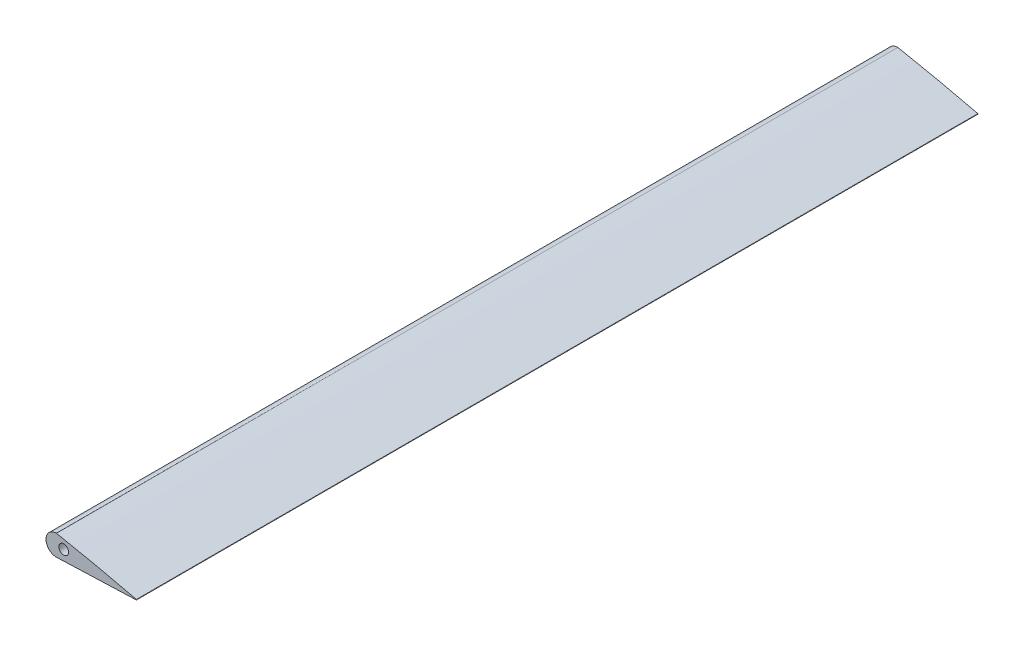
ISO-10303-21;
HEADER;
FILE_DESCRIPTION(('STEP AP214'),'2;1');
FILE_NAME('part.step','',(''),(''),'','','');
FILE_SCHEMA(('AUTOMOTIVE_DESIGN { 1 0 10303 214 1 1 1 1 }'));
ENDSEC;
DATA;
#1=APPLICATION_CONTEXT('core data for automotive mechanical design processes');
#2=APPLICATION_PROTOCOL_DEFINITION('international standard','automotive_design',2000,#1);
#3=PRODUCT_CONTEXT('',#1,'mechanical');
#4=PRODUCT('Part','Part','',(#3));
#5=PRODUCT_RELATED_PRODUCT_CATEGORY('part','',(#4));
#6=PRODUCT_DEFINITION_FORMATION('','',#4);
#7=PRODUCT_DEFINITION_CONTEXT('part definition',#1,'design');
#8=PRODUCT_DEFINITION('design','',#6,#7);
#9=PRODUCT_DEFINITION_SHAPE('','',#8);
#10=(LENGTH_UNIT() NAMED_UNIT(*) SI_UNIT(.MILLI.,.METRE.));
#11=(NAMED_UNIT(*) PLANE_ANGLE_UNIT() SI_UNIT($,.RADIAN.));
#12=(NAMED_UNIT(*) SI_UNIT($,.STERADIAN.) SOLID_ANGLE_UNIT());
#13=UNCERTAINTY_MEASURE_WITH_UNIT(LENGTH_MEASURE(1.E-05),#10,'distance_accuracy_value','');
#14=(GEOMETRIC_REPRESENTATION_CONTEXT(3) GLOBAL_UNCERTAINTY_ASSIGNED_CONTEXT((#13)) GLOBAL_UNIT_ASSIGNED_CONTEXT((#10,
#11,#12)) REPRESENTATION_CONTEXT('',''));
#15=CARTESIAN_POINT('',(0.,0.,0.));
#16=DIRECTION('',(0.,0.,1.));
#17=DIRECTION('',(1.,0.,0.));
#18=AXIS2_PLACEMENT_3D('',#15,#16,#17);
#19=CARTESIAN_POINT('',(164.,0.098236,1246.6));
#20=CARTESIAN_POINT('',(163.453347386671,0.227855350458952,1246.6));
#21=CARTESIAN_POINT('',(162.360115671758,0.487076620664547,1246.6));
#22=CARTESIAN_POINT('',(160.720174081031,0.8748027913242,1246.6));
#23=CARTESIAN_POINT('',(159.080335299599,1.2611135108875,1246.6));
#24=CARTESIAN_POINT('',(156.894331895889,1.77189659204999,1246.6));
#25=CARTESIAN_POINT('',(154.161962419369,2.40100802385925,1246.6));
#26=CARTESIAN_POINT('',(150.881840500926,3.1375256901344,1246.6));
#27=CARTESIAN_POINT('',(147.601664877829,3.85659449964915,1246.6));
#28=CARTESIAN_POINT('',(144.321701501382,4.55985226737601,1246.6));
#29=CARTESIAN_POINT('',(141.041699291482,5.24621809732109,1246.6));
#30=CARTESIAN_POINT('',(137.761756820069,5.91557197661805,1246.6));
#31=CARTESIAN_POINT('',(134.481686048208,6.56653427941028,1246.6));
#32=CARTESIAN_POINT('',(131.201761117117,7.19989778417141,1246.6));
#33=CARTESIAN_POINT('',(127.921667907918,7.81375356606383,1246.6));
#34=CARTESIAN_POINT('',(124.641700877236,8.40917183607385,1246.6));
#35=CARTESIAN_POINT('',(121.361597548386,8.98464976190136,1246.6));
#36=CARTESIAN_POINT('',(118.081600920828,9.54128435164297,1246.6));
#37=CARTESIAN_POINT('',(114.801560540038,10.0780590298297,1246.6));
#38=CARTESIAN_POINT('',(111.521600724131,10.5950345799163,1246.6));
#39=CARTESIAN_POINT('',(108.241713881351,11.0909646842955,1246.6));
#40=CARTESIAN_POINT('',(104.961715387484,11.5629261888805,1246.6));
#41=CARTESIAN_POINT('',(101.681785544589,12.0101669419683,1246.6));
#42=CARTESIAN_POINT('',(98.4017469245326,12.4297089334238,1246.6));
#43=CARTESIAN_POINT('',(95.1216630030627,12.8204998785934,1246.6));
#44=CARTESIAN_POINT('',(91.8415424202874,13.1818311954848,1246.6));
#45=CARTESIAN_POINT('',(88.5614135801748,13.5136296911863,1246.6));
#46=CARTESIAN_POINT('',(85.2812830129089,13.815893693455,1246.6));
#47=CARTESIAN_POINT('',(82.0011692178232,14.0886945475444,1246.6));
#48=CARTESIAN_POINT('',(78.721094583004,14.3317408411769,1246.6));
#49=CARTESIAN_POINT('',(75.4410212023817,14.5431745258036,1246.6));
#50=CARTESIAN_POINT('',(72.1608949429442,14.7199129290163,1246.6));
#51=CARTESIAN_POINT('',(68.8807258367621,14.8594278594699,1246.6));
#52=CARTESIAN_POINT('',(65.6005029177586,14.9591611868157,1246.6));
#53=CARTESIAN_POINT('',(62.3202248877231,15.0161184911894,1246.6));
#54=CARTESIAN_POINT('',(59.0399904849592,15.0330111129914,1246.6));
#55=CARTESIAN_POINT('',(55.7598149007794,15.012803506004,1246.6));
#56=CARTESIAN_POINT('',(52.4796814465771,14.9596338867567,1246.6));
#57=CARTESIAN_POINT('',(49.1996020231385,14.8756453845849,1246.6));
#58=CARTESIAN_POINT('',(45.9192330465041,14.7668246976276,1246.6));
#59=CARTESIAN_POINT('',(42.6385376039657,14.6188266715463,1246.6));
#60=CARTESIAN_POINT('',(39.3574161799392,14.4160226283782,1246.6));
#61=CARTESIAN_POINT('',(36.0757975000136,14.1416033611045,1246.6));
#62=CARTESIAN_POINT('',(32.7935336386632,13.7797355777745,1246.6));
#63=CARTESIAN_POINT('',(29.5117490863587,13.311848816541,1246.6));
#64=CARTESIAN_POINT('',(26.2304347877456,12.7369411502886,1246.6));
#65=CARTESIAN_POINT('',(22.9482106391067,12.0590867159985,1246.6));
#66=CARTESIAN_POINT('',(19.6639743780453,11.2714313088833,1246.6));
#67=CARTESIAN_POINT('',(16.3781154279843,10.3517379968201,1246.6));
#68=CARTESIAN_POINT('',(13.0927390351379,9.27164991130654,1246.6));
#69=CARTESIAN_POINT('',(10.3581556975564,8.23985590536731,1246.6));
#70=CARTESIAN_POINT('',(8.17874341440028,7.26915270171108,1246.6));
#71=CARTESIAN_POINT('',(6.52711920655236,6.42362871815544,1246.6));
#72=CARTESIAN_POINT('',(4.8606326051585,5.41901455288728,1246.6));
#73=CARTESIAN_POINT('',(3.32216784213193,4.2467281999024,1246.6));
#74=CARTESIAN_POINT('',(2.16677990383352,3.13421853144612,1246.6));
#75=CARTESIAN_POINT('',(1.28484362701116,2.24003834899123,1246.6));
#76=CARTESIAN_POINT('',(0.72477847607304,1.58632625202643,1246.6));
#77=CARTESIAN_POINT('',(0.35648721556683,1.02371456627432,1246.6));
#78=CARTESIAN_POINT('',(0.176338644180926,0.655158851073157,1246.6));
#79=CARTESIAN_POINT('',(0.0612611395106372,0.337632955086773,1246.6));
#80=CARTESIAN_POINT('',(-0.0429121865202662,-0.121140296790297,1246.6));
#81=CARTESIAN_POINT('',(0.010077208925072,-0.598533270573657,1246.6));
#82=CARTESIAN_POINT('',(0.176198667745624,-1.01407787652228,1246.6));
#83=CARTESIAN_POINT('',(0.354673421549138,-1.34452507475123,1246.6));
#84=CARTESIAN_POINT('',(0.717110179714685,-1.82624030553599,1246.6));
#85=CARTESIAN_POINT('',(1.26977260153434,-2.33677484867151,1246.6));
#86=CARTESIAN_POINT('',(2.13175393776129,-2.92020441398472,1246.6));
#87=CARTESIAN_POINT('',(3.35494447776376,-3.3927891066928,1246.6));
#88=CARTESIAN_POINT('',(4.91531848514269,-3.70716670555496,1246.6));
#89=CARTESIAN_POINT('',(6.55415647727891,-4.03304969461932,1246.6));
#90=CARTESIAN_POINT('',(8.19533877766632,-4.28351567057608,1246.6));
#91=CARTESIAN_POINT('',(10.3822695733583,-4.51540047764127,1246.6));
#92=CARTESIAN_POINT('',(13.1186249251783,-4.67265304154677,1246.6));
#93=CARTESIAN_POINT('',(16.3988579729893,-4.82847557553279,1246.6));
#94=CARTESIAN_POINT('',(19.6794940200121,-4.9221269224633,1246.6));
#95=CARTESIAN_POINT('',(22.9598439452861,-4.96653444382741,1246.6));
#96=CARTESIAN_POINT('',(26.2400949207719,-4.9678853332589,1246.6));
#97=CARTESIAN_POINT('',(29.5202180796211,-4.93284058420912,1246.6));
#98=CARTESIAN_POINT('',(32.8002579900583,-4.8689493564345,1246.6));
#99=CARTESIAN_POINT('',(36.080251417321,-4.78267153882756,1246.6));
#100=CARTESIAN_POINT('',(39.360205991376,-4.67900202490651,1246.6));
#101=CARTESIAN_POINT('',(42.6401302310176,-4.56299213669189,1246.6));
#102=CARTESIAN_POINT('',(45.9200507833793,-4.43994519774915,1246.6));
#103=CARTESIAN_POINT('',(49.1999634238303,-4.31409585740894,1246.6));
#104=CARTESIAN_POINT('',(52.479955348434,-4.19074867403074,1246.6));
#105=CARTESIAN_POINT('',(55.7599812015837,-4.07002215466733,1246.6));
#106=CARTESIAN_POINT('',(59.0399831910091,-3.95007972297037,1246.6));
#107=CARTESIAN_POINT('',(62.3200043820552,-3.83126992795704,1246.6));
#108=CARTESIAN_POINT('',(65.6000091855952,-3.71206420486596,1246.6));
#109=CARTESIAN_POINT('',(68.8800086095087,-3.59232744073866,1246.6));
#110=CARTESIAN_POINT('',(72.1600102889574,-3.47216006055257,1246.6));
#111=CARTESIAN_POINT('',(75.4399983284211,-3.35129455058597,1246.6));
#112=CARTESIAN_POINT('',(78.7200044224965,-3.23070144154958,1246.6));
#113=CARTESIAN_POINT('',(81.9999960438394,-3.10971523913052,1246.6));
#114=CARTESIAN_POINT('',(85.2799973322548,-2.98904612003693,1246.6));
#115=CARTESIAN_POINT('',(88.5599965582764,-2.86848494516658,1246.6));
#116=CARTESIAN_POINT('',(91.8400003924801,-2.74815868844688,1246.6));
#117=CARTESIAN_POINT('',(95.1199998668713,-2.62776837459643,1246.6));
#118=CARTESIAN_POINT('',(98.4000001400348,-2.50739981316743,1246.6));
#119=CARTESIAN_POINT('',(101.67999957299,-2.38700837273386,1246.6));
#120=CARTESIAN_POINT('',(104.960003572939,-2.26668662234937,1246.6));
#121=CARTESIAN_POINT('',(108.240000169761,-2.14610862248626,1246.6));
#122=CARTESIAN_POINT('',(111.519995748018,-2.02550288772255,1246.6));
#123=CARTESIAN_POINT('',(114.80000480859,-1.90526426839036,1246.6));
#124=CARTESIAN_POINT('',(118.079995042267,-1.78456767053152,1246.6));
#125=CARTESIAN_POINT('',(121.360004997696,-1.66435341763084,1246.6));
#126=CARTESIAN_POINT('',(124.639994991596,-1.54365029078787,1246.6));
#127=CARTESIAN_POINT('',(127.920005011275,-1.42343778737223,1246.6));
#128=CARTESIAN_POINT('',(131.199994987952,-1.30273419156792,1246.6));
#129=CARTESIAN_POINT('',(134.480005012271,-1.18252181451118,1246.6));
#130=CARTESIAN_POINT('',(137.759994987609,-1.06181818223221,1246.6));
#131=CARTESIAN_POINT('',(141.040005012646,-0.941605824715075,1246.6));
#132=CARTESIAN_POINT('',(144.319994986453,-0.820902150752307,1246.6));
#133=CARTESIAN_POINT('',(147.600005016897,-0.700689940430646,1246.6));
#134=CARTESIAN_POINT('',(150.879994970606,-0.579985719369323,1246.6));
#135=CARTESIAN_POINT('',(154.160005076031,-0.459775550244729,1246.6));
#136=CARTESIAN_POINT('',(156.893330138421,-0.359182338982628,1246.6));
#137=CARTESIAN_POINT('',(159.080000324789,-0.278972841706895,1246.6));
#138=CARTESIAN_POINT('',(160.719999512133,-0.218762723666091,1246.6));
#139=CARTESIAN_POINT('',(162.360003632975,-0.15863219006814,1246.6));
#140=CARTESIAN_POINT('',(163.453333875564,-0.118368087984547,1246.6));
#141=CARTESIAN_POINT('',(164.,-0.098236,1246.6));
#142=B_SPLINE_CURVE_WITH_KNOTS('',3,(#19,#20,#21,#22,#23,#24,#25,#26,#27,#28,#29,#30,#31,#32,
#33,#34,#35,#36,#37,#38,#39,#40,#41,#42,#43,#44,#45,#46,#47,#48,#49,#50,#51,#52,#53,#54,#55,#56,
#57,#58,#59,#60,#61,#62,#63,#64,#65,#66,#67,#68,#69,#70,#71,#72,#73,#74,#75,#76,#77,#78,#79,#80,
#81,#82,#83,#84,#85,#86,#87,#88,#89,#90,#91,#92,#93,#94,#95,#96,#97,#98,#99,#100,#101,#102,#103,
#104,#105,#106,#107,#108,#109,#110,#111,#112,#113,#114,#115,#116,#117,#118,#119,#120,#121,#122,
#123,#124,#125,#126,#127,#128,#129,#130,#131,#132,#133,#134,#135,#136,#137,#138,#139,#140,#141),
.UNSPECIFIED.,.F.,.F.,(4,1,1,1,1,1,1,1,1,1,1,1,1,1,1,1,1,1,1,1,1,1,1,1,1,1,1,1,1,1,1,1,1,1,1,1,
1,1,1,1,1,1,1,1,1,1,1,1,1,1,1,1,1,1,1,1,1,1,1,1,1,1,1,1,1,1,1,1,1,1,1,1,1,1,1,1,1,1,1,1,1,1,1,1,
1,1,1,1,1,1,1,1,1,1,1,1,1,1,1,1,1,1,1,1,1,1,1,1,1,1,1,1,1,1,1,1,1,1,1,1,4),(0.,
0.00502783507920503,0.0100549940344634,0.0150810297240759,0.0201050549080901,0.0301452607809432,
0.0401736458927437,0.0501907944797704,0.060197679895013,0.0701942255550732,0.0801803766412489,
0.0901559102827991,0.100121105793046,0.110075702815163,0.120020101260909,0.12995427083149,
0.139878706126609,0.149793490904472,0.159698811392375,0.169594433213407,0.179479778460019,
0.189354743837751,0.199219015443769,0.209072795450207,0.218916602866618,0.228751158154273,
0.238577241843568,0.248395636485294,0.258207018047657,0.268011852233636,0.277810604067606,
0.28760402315173,0.297393126728297,0.30717925271197,0.316964017963334,0.326748818989175,
0.336534714870927,0.346322473718417,0.356112722227348,0.365907651807351,0.375711463271153,
0.385530878969925,0.395375762487733,0.405259304622106,0.415192461064141,0.425184025337781,
0.435248335040234,0.445412190892236,0.455710778825161,0.466190958855658,0.471552192168147,
0.477054503678275,0.482786726573929,0.488945835105149,0.494316032866102,0.497126416153154,
0.500187367762256,0.50200086881537,0.50312820232303,0.503849971017213,0.505020136520667,
0.507317904862695,0.507986558007653,0.509023585585765,0.510668218535329,0.513358347504693,
0.515715811851598,0.519949385272463,0.524973187970153,0.529954400275476,0.534903201933464,
0.539824122915189,0.549630394385822,0.559425368878799,0.569214167199772,0.578999733437889,
0.588784364017046,0.598569510856094,0.608355932640458,0.618143879841103,0.627933314763685,
0.637723968115275,0.647515400204077,0.657307127187741,0.667098669129828,0.676889956114584,
0.68668111741491,0.69647218967302,0.706263279690747,0.716054423133804,0.725845620221906,
0.735636871174765,0.745428122127623,0.755219391084224,0.765010642037082,0.774801875010609,
0.784593090029218,0.794384305047826,0.804175520066435,0.813966735085043,0.823757950103652,
0.833549183077179,0.843340416050707,0.853131631069315,0.862922864042843,0.872714079061451,
0.882505312034978,0.892296527053587,0.902087760027114,0.911878975045723,0.92167020801925,
0.931461423037859,0.941252656011386,0.951043871029995,0.960835104003522,0.970626319022131,
0.980417551995658,0.985313159504962,0.990208767014267,0.995104374523571,1.),.UNSPECIFIED.);
#143=DIRECTION('',(0.,0.,-1.));
#144=VECTOR('',#143,1.);
#145=SURFACE_OF_LINEAR_EXTRUSION('',#142,#144);
#146=CARTESIAN_POINT('',(164.,0.098236,344.25));
#147=CARTESIAN_POINT('',(163.453347386671,0.227855350458952,344.25));
#148=CARTESIAN_POINT('',(162.360115671758,0.487076620664547,344.25));
#149=CARTESIAN_POINT('',(160.720174081031,0.8748027913242,344.25));
#150=CARTESIAN_POINT('',(159.080335299599,1.2611135108875,344.25));
#151=CARTESIAN_POINT('',(156.894331895889,1.77189659204999,344.25));
#152=CARTESIAN_POINT('',(154.161962419369,2.40100802385925,344.25));
#153=CARTESIAN_POINT('',(150.881840500926,3.1375256901344,344.25));
#154=CARTESIAN_POINT('',(147.601664877829,3.85659449964915,344.25));
#155=CARTESIAN_POINT('',(144.321701501382,4.55985226737601,344.25));
#156=CARTESIAN_POINT('',(141.041699291482,5.24621809732109,344.25));
#157=CARTESIAN_POINT('',(137.761756820069,5.91557197661805,344.25));
#158=CARTESIAN_POINT('',(134.481686048208,6.56653427941028,344.25));
#159=CARTESIAN_POINT('',(131.201761117117,7.19989778417141,344.25));
#160=CARTESIAN_POINT('',(127.921667907918,7.81375356606383,344.25));
#161=CARTESIAN_POINT('',(124.641700877236,8.40917183607385,344.25));
#162=CARTESIAN_POINT('',(121.361597548386,8.98464976190136,344.25));
#163=CARTESIAN_POINT('',(118.081600920828,9.54128435164297,344.25));
#164=CARTESIAN_POINT('',(114.801560540038,10.0780590298297,344.25));
#165=CARTESIAN_POINT('',(111.521600724131,10.5950345799163,344.25));
#166=CARTESIAN_POINT('',(108.241713881351,11.0909646842955,344.25));
#167=CARTESIAN_POINT('',(104.961715387484,11.5629261888805,344.25));
#168=CARTESIAN_POINT('',(101.681785544589,12.0101669419683,344.25));
#169=CARTESIAN_POINT('',(98.4017469245326,12.4297089334238,344.25));
#170=CARTESIAN_POINT('',(95.1216630030627,12.8204998785934,344.25));
#171=CARTESIAN_POINT('',(91.8415424202874,13.1818311954848,344.25));
#172=CARTESIAN_POINT('',(88.5614135801748,13.5136296911863,344.25));
#173=CARTESIAN_POINT('',(85.2812830129089,13.815893693455,344.25));
#174=CARTESIAN_POINT('',(82.0011692178232,14.0886945475444,344.25));
#175=CARTESIAN_POINT('',(78.721094583004,14.3317408411769,344.25));
#176=CARTESIAN_POINT('',(75.4410212023817,14.5431745258036,344.25));
#177=CARTESIAN_POINT('',(72.1608949429442,14.7199129290163,344.25));
#178=CARTESIAN_POINT('',(68.8807258367621,14.8594278594699,344.25));
#179=CARTESIAN_POINT('',(65.6005029177586,14.9591611868157,344.25));
#180=CARTESIAN_POINT('',(62.3202248877231,15.0161184911894,344.25));
#181=CARTESIAN_POINT('',(59.0399904849592,15.0330111129914,344.25));
#182=CARTESIAN_POINT('',(55.7598149007794,15.012803506004,344.25));
#183=CARTESIAN_POINT('',(52.4796814465771,14.9596338867567,344.25));
#184=CARTESIAN_POINT('',(49.1996020231385,14.8756453845849,344.25));
#185=CARTESIAN_POINT('',(45.9192330465041,14.7668246976276,344.25));
#186=CARTESIAN_POINT('',(42.6385376039657,14.6188266715463,344.25));
#187=CARTESIAN_POINT('',(39.3574161799392,14.4160226283782,344.25));
#188=CARTESIAN_POINT('',(36.0757975000136,14.1416033611045,344.25));
#189=CARTESIAN_POINT('',(32.7935336386632,13.7797355777745,344.25));
#190=CARTESIAN_POINT('',(29.5117490863587,13.311848816541,344.25));
#191=CARTESIAN_POINT('',(26.2304347877456,12.7369411502886,344.25));
#192=CARTESIAN_POINT('',(22.9482106391067,12.0590867159985,344.25));
#193=CARTESIAN_POINT('',(19.6639743780453,11.2714313088833,344.25));
#194=CARTESIAN_POINT('',(16.3781154279843,10.3517379968201,344.25));
#195=CARTESIAN_POINT('',(13.0927390351379,9.27164991130654,344.25));
#196=CARTESIAN_POINT('',(10.3581556975564,8.23985590536731,344.25));
#197=CARTESIAN_POINT('',(8.17874341440028,7.26915270171108,344.25));
#198=CARTESIAN_POINT('',(6.52711920655236,6.42362871815544,344.25));
#199=CARTESIAN_POINT('',(4.8606326051585,5.41901455288728,344.25));
#200=CARTESIAN_POINT('',(3.32216784213193,4.2467281999024,344.25));
#201=CARTESIAN_POINT('',(2.16677990383352,3.13421853144612,344.25));
#202=CARTESIAN_POINT('',(1.28484362701116,2.24003834899123,344.25));
#203=CARTESIAN_POINT('',(0.72477847607304,1.58632625202643,344.25));
#204=CARTESIAN_POINT('',(0.35648721556683,1.02371456627432,344.25));
#205=CARTESIAN_POINT('',(0.176338644180926,0.655158851073157,344.25));
#206=CARTESIAN_POINT('',(0.0612611395106372,0.337632955086773,344.25));
#207=CARTESIAN_POINT('',(-0.0429121865202662,-0.121140296790297,344.25));
#208=CARTESIAN_POINT('',(0.010077208925072,-0.598533270573657,344.25));
#209=CARTESIAN_POINT('',(0.176198667745624,-1.01407787652228,344.25));
#210=CARTESIAN_POINT('',(0.354673421549138,-1.34452507475123,344.25));
#211=CARTESIAN_POINT('',(0.717110179714685,-1.82624030553599,344.25));
#212=CARTESIAN_POINT('',(1.26977260153434,-2.33677484867151,344.25));
#213=CARTESIAN_POINT('',(2.13175393776129,-2.92020441398472,344.25));
#214=CARTESIAN_POINT('',(3.35494447776376,-3.3927891066928,344.25));
#215=CARTESIAN_POINT('',(4.91531848514269,-3.70716670555496,344.25));
#216=CARTESIAN_POINT('',(6.55415647727891,-4.03304969461932,344.25));
#217=CARTESIAN_POINT('',(8.19533877766632,-4.28351567057608,344.25));
#218=CARTESIAN_POINT('',(10.3822695733583,-4.51540047764127,344.25));
#219=CARTESIAN_POINT('',(13.1186249251783,-4.67265304154677,344.25));
#220=CARTESIAN_POINT('',(16.3988579729893,-4.82847557553279,344.25));
#221=CARTESIAN_POINT('',(19.6794940200121,-4.9221269224633,344.25));
#222=CARTESIAN_POINT('',(22.9598439452861,-4.96653444382741,344.25));
#223=CARTESIAN_POINT('',(26.2400949207719,-4.9678853332589,344.25));
#224=CARTESIAN_POINT('',(29.5202180796211,-4.93284058420912,344.25));
#225=CARTESIAN_POINT('',(32.8002579900583,-4.8689493564345,344.25));
#226=CARTESIAN_POINT('',(36.080251417321,-4.78267153882756,344.25));
#227=CARTESIAN_POINT('',(39.360205991376,-4.67900202490651,344.25));
#228=CARTESIAN_POINT('',(42.6401302310176,-4.56299213669189,344.25));
#229=CARTESIAN_POINT('',(45.9200507833793,-4.43994519774915,344.25));
#230=CARTESIAN_POINT('',(49.1999634238303,-4.31409585740894,344.25));
#231=CARTESIAN_POINT('',(52.479955348434,-4.19074867403074,344.25));
#232=CARTESIAN_POINT('',(55.7599812015837,-4.07002215466733,344.25));
#233=CARTESIAN_POINT('',(59.0399831910091,-3.95007972297037,344.25));
#234=CARTESIAN_POINT('',(62.3200043820552,-3.83126992795704,344.25));
#235=CARTESIAN_POINT('',(65.6000091855952,-3.71206420486596,344.25));
#236=CARTESIAN_POINT('',(68.8800086095087,-3.59232744073866,344.25));
#237=CARTESIAN_POINT('',(72.1600102889574,-3.47216006055257,344.25));
#238=CARTESIAN_POINT('',(75.4399983284211,-3.35129455058597,344.25));
#239=CARTESIAN_POINT('',(78.7200044224965,-3.23070144154958,344.25));
#240=CARTESIAN_POINT('',(81.9999960438394,-3.10971523913052,344.25));
#241=CARTESIAN_POINT('',(85.2799973322548,-2.98904612003693,344.25));
#242=CARTESIAN_POINT('',(88.5599965582764,-2.86848494516658,344.25));
#243=CARTESIAN_POINT('',(91.8400003924801,-2.74815868844688,344.25));
#244=CARTESIAN_POINT('',(95.1199998668713,-2.62776837459643,344.25));
#245=CARTESIAN_POINT('',(98.4000001400348,-2.50739981316743,344.25));
#246=CARTESIAN_POINT('',(101.67999957299,-2.38700837273386,344.25));
#247=CARTESIAN_POINT('',(104.960003572939,-2.26668662234937,344.25));
#248=CARTESIAN_POINT('',(108.240000169761,-2.14610862248626,344.25));
#249=CARTESIAN_POINT('',(111.519995748018,-2.02550288772255,344.25));
#250=CARTESIAN_POINT('',(114.80000480859,-1.90526426839036,344.25));
#251=CARTESIAN_POINT('',(118.079995042267,-1.78456767053152,344.25));
#252=CARTESIAN_POINT('',(121.360004997696,-1.66435341763084,344.25));
#253=CARTESIAN_POINT('',(124.639994991596,-1.54365029078787,344.25));
#254=CARTESIAN_POINT('',(127.920005011275,-1.42343778737223,344.25));
#255=CARTESIAN_POINT('',(131.199994987952,-1.30273419156792,344.25));
#256=CARTESIAN_POINT('',(134.480005012271,-1.18252181451118,344.25));
#257=CARTESIAN_POINT('',(137.759994987609,-1.06181818223221,344.25));
#258=CARTESIAN_POINT('',(141.040005012646,-0.941605824715075,344.25));
#259=CARTESIAN_POINT('',(144.319994986453,-0.820902150752307,344.25));
#260=CARTESIAN_POINT('',(147.600005016897,-0.700689940430646,344.25));
#261=CARTESIAN_POINT('',(150.879994970606,-0.579985719369323,344.25));
#262=CARTESIAN_POINT('',(154.160005076031,-0.459775550244729,344.25));
#263=CARTESIAN_POINT('',(156.893330138421,-0.359182338982628,344.25));
#264=CARTESIAN_POINT('',(159.080000324789,-0.278972841706895,344.25));
#265=CARTESIAN_POINT('',(160.719999512133,-0.218762723666091,344.25));
#266=CARTESIAN_POINT('',(162.360003632975,-0.15863219006814,344.25));
#267=CARTESIAN_POINT('',(163.453333875564,-0.118368087984547,344.25));
#268=CARTESIAN_POINT('',(164.,-0.098236,344.25));
#269=B_SPLINE_CURVE_WITH_KNOTS('',3,(#146,#147,#148,#149,#150,#151,#152,#153,#154,#155,#156,
#157,#158,#159,#160,#161,#162,#163,#164,#165,#166,#167,#168,#169,#170,#171,#172,#173,#174,#175,
#176,#177,#178,#179,#180,#181,#182,#183,#184,#185,#186,#187,#188,#189,#190,#191,#192,#193,#194,
#195,#196,#197,#198,#199,#200,#201,#202,#203,#204,#205,#206,#207,#208,#209,#210,#211,#212,#213,
#214,#215,#216,#217,#218,#219,#220,#221,#222,#223,#224,#225,#226,#227,#228,#229,#230,#231,#232,
#233,#234,#235,#236,#237,#238,#239,#240,#241,#242,#243,#244,#245,#246,#247,#248,#249,#250,#251,
#252,#253,#254,#255,#256,#257,#258,#259,#260,#261,#262,#263,#264,#265,#266,#267,#268),
.UNSPECIFIED.,.F.,.F.,(4,1,1,1,1,1,1,1,1,1,1,1,1,1,1,1,1,1,1,1,1,1,1,1,1,1,1,1,1,1,1,1,1,1,1,1,
1,1,1,1,1,1,1,1,1,1,1,1,1,1,1,1,1,1,1,1,1,1,1,1,1,1,1,1,1,1,1,1,1,1,1,1,1,1,1,1,1,1,1,1,1,1,1,1,
1,1,1,1,1,1,1,1,1,1,1,1,1,1,1,1,1,1,1,1,1,1,1,1,1,1,1,1,1,1,1,1,1,1,1,1,4),(0.,
0.00502783507920503,0.0100549940344634,0.0150810297240759,0.0201050549080901,0.0301452607809432,
0.0401736458927437,0.0501907944797704,0.060197679895013,0.0701942255550732,0.0801803766412489,
0.0901559102827991,0.100121105793046,0.110075702815163,0.120020101260909,0.12995427083149,
0.139878706126609,0.149793490904472,0.159698811392375,0.169594433213407,0.179479778460019,
0.189354743837751,0.199219015443769,0.209072795450207,0.218916602866618,0.228751158154273,
0.238577241843568,0.248395636485294,0.258207018047657,0.268011852233636,0.277810604067606,
0.28760402315173,0.297393126728297,0.30717925271197,0.316964017963334,0.326748818989175,
0.336534714870927,0.346322473718417,0.356112722227348,0.365907651807351,0.375711463271153,
0.385530878969925,0.395375762487733,0.405259304622106,0.415192461064141,0.425184025337781,
0.435248335040234,0.445412190892236,0.455710778825161,0.466190958855658,0.471552192168147,
0.477054503678275,0.482786726573929,0.488945835105149,0.494316032866102,0.497126416153154,
0.500187367762256,0.50200086881537,0.50312820232303,0.503849971017213,0.505020136520667,
0.507317904862695,0.507986558007653,0.509023585585765,0.510668218535329,0.513358347504693,
0.515715811851598,0.519949385272463,0.524973187970153,0.529954400275476,0.534903201933464,
0.539824122915189,0.549630394385822,0.559425368878799,0.569214167199772,0.578999733437889,
0.588784364017046,0.598569510856094,0.608355932640458,0.618143879841103,0.627933314763685,
0.637723968115275,0.647515400204077,0.657307127187741,0.667098669129828,0.676889956114584,
0.68668111741491,0.69647218967302,0.706263279690747,0.716054423133804,0.725845620221906,
0.735636871174765,0.745428122127623,0.755219391084224,0.765010642037082,0.774801875010609,
0.784593090029218,0.794384305047826,0.804175520066435,0.813966735085043,0.823757950103652,
0.833549183077179,0.843340416050707,0.853131631069315,0.862922864042843,0.872714079061451,
0.882505312034978,0.892296527053587,0.902087760027114,0.911878975045723,0.92167020801925,
0.931461423037859,0.941252656011386,0.951043871029995,0.960835104003522,0.970626319022131,
0.980417551995658,0.985313159504962,0.990208767014267,0.995104374523571,1.),.UNSPECIFIED.);
#270=CARTESIAN_POINT('',(164.,0.0982360000001403,344.25));
#271=VERTEX_POINT('',#270);
#272=CARTESIAN_POINT('',(131.277666630675,7.18220445125656,344.25));
#273=VERTEX_POINT('',#272);
#274=EDGE_CURVE('E91',#271,#273,#269,.T.);
#275=ORIENTED_EDGE('',*,*,#274,.F.);
#276=DIRECTION('',(0.,0.,-1.));
#277=VECTOR('',#276,1.);
#278=CARTESIAN_POINT('',(164.,0.0982359999999605,1246.6));
#279=LINE('',#278,#277);
#280=CARTESIAN_POINT('',(164.,0.0982359999999183,0.));
#281=VERTEX_POINT('',#280);
#282=EDGE_CURVE('E53',#281,#271,#279,.F.);
#283=ORIENTED_EDGE('',*,*,#282,.F.);
#284=CARTESIAN_POINT('',(164.,0.098236,0.));
#285=CARTESIAN_POINT('',(163.453347386671,0.227855350458952,0.));
#286=CARTESIAN_POINT('',(162.360115671758,0.487076620664547,0.));
#287=CARTESIAN_POINT('',(160.720174081031,0.8748027913242,0.));
#288=CARTESIAN_POINT('',(159.080335299599,1.2611135108875,0.));
#289=CARTESIAN_POINT('',(156.894331895889,1.77189659204999,0.));
#290=CARTESIAN_POINT('',(154.161962419369,2.40100802385925,0.));
#291=CARTESIAN_POINT('',(150.881840500926,3.1375256901344,0.));
#292=CARTESIAN_POINT('',(147.601664877829,3.85659449964915,0.));
#293=CARTESIAN_POINT('',(144.321701501382,4.55985226737601,0.));
#294=CARTESIAN_POINT('',(141.041699291482,5.24621809732109,0.));
#295=CARTESIAN_POINT('',(137.761756820069,5.91557197661805,0.));
#296=CARTESIAN_POINT('',(134.481686048208,6.56653427941028,0.));
#297=CARTESIAN_POINT('',(131.201761117117,7.19989778417141,0.));
#298=CARTESIAN_POINT('',(127.921667907918,7.81375356606383,0.));
#299=CARTESIAN_POINT('',(124.641700877236,8.40917183607385,0.));
#300=CARTESIAN_POINT('',(121.361597548386,8.98464976190136,0.));
#301=CARTESIAN_POINT('',(118.081600920828,9.54128435164297,0.));
#302=CARTESIAN_POINT('',(114.801560540038,10.0780590298297,0.));
#303=CARTESIAN_POINT('',(111.521600724131,10.5950345799163,0.));
#304=CARTESIAN_POINT('',(108.241713881351,11.0909646842955,0.));
#305=CARTESIAN_POINT('',(104.961715387484,11.5629261888805,0.));
#306=CARTESIAN_POINT('',(101.681785544589,12.0101669419683,0.));
#307=CARTESIAN_POINT('',(98.4017469245326,12.4297089334238,0.));
#308=CARTESIAN_POINT('',(95.1216630030627,12.8204998785934,0.));
#309=CARTESIAN_POINT('',(91.8415424202874,13.1818311954848,0.));
#310=CARTESIAN_POINT('',(88.5614135801748,13.5136296911863,0.));
#311=CARTESIAN_POINT('',(85.2812830129089,13.815893693455,0.));
#312=CARTESIAN_POINT('',(82.0011692178232,14.0886945475444,0.));
#313=CARTESIAN_POINT('',(78.721094583004,14.3317408411769,0.));
#314=CARTESIAN_POINT('',(75.4410212023817,14.5431745258036,0.));
#315=CARTESIAN_POINT('',(72.1608949429442,14.7199129290163,0.));
#316=CARTESIAN_POINT('',(68.8807258367621,14.8594278594699,0.));
#317=CARTESIAN_POINT('',(65.6005029177586,14.9591611868157,0.));
#318=CARTESIAN_POINT('',(62.3202248877231,15.0161184911894,0.));
#319=CARTESIAN_POINT('',(59.0399904849592,15.0330111129914,0.));
#320=CARTESIAN_POINT('',(55.7598149007794,15.012803506004,0.));
#321=CARTESIAN_POINT('',(52.4796814465771,14.9596338867567,0.));
#322=CARTESIAN_POINT('',(49.1996020231385,14.8756453845849,0.));
#323=CARTESIAN_POINT('',(45.9192330465041,14.7668246976276,0.));
#324=CARTESIAN_POINT('',(42.6385376039657,14.6188266715463,0.));
#325=CARTESIAN_POINT('',(39.3574161799392,14.4160226283782,0.));
#326=CARTESIAN_POINT('',(36.0757975000136,14.1416033611045,0.));
#327=CARTESIAN_POINT('',(32.7935336386632,13.7797355777745,0.));
#328=CARTESIAN_POINT('',(29.5117490863587,13.311848816541,0.));
#329=CARTESIAN_POINT('',(26.2304347877456,12.7369411502886,0.));
#330=CARTESIAN_POINT('',(22.9482106391067,12.0590867159985,0.));
#331=CARTESIAN_POINT('',(19.6639743780453,11.2714313088833,0.));
#332=CARTESIAN_POINT('',(16.3781154279843,10.3517379968201,0.));
#333=CARTESIAN_POINT('',(13.0927390351379,9.27164991130654,0.));
#334=CARTESIAN_POINT('',(10.3581556975564,8.23985590536731,0.));
#335=CARTESIAN_POINT('',(8.17874341440028,7.26915270171108,0.));
#336=CARTESIAN_POINT('',(6.52711920655236,6.42362871815544,0.));
#337=CARTESIAN_POINT('',(4.8606326051585,5.41901455288728,0.));
#338=CARTESIAN_POINT('',(3.32216784213193,4.2467281999024,0.));
#339=CARTESIAN_POINT('',(2.16677990383352,3.13421853144612,0.));
#340=CARTESIAN_POINT('',(1.28484362701116,2.24003834899123,0.));
#341=CARTESIAN_POINT('',(0.72477847607304,1.58632625202643,0.));
#342=CARTESIAN_POINT('',(0.35648721556683,1.02371456627432,0.));
#343=CARTESIAN_POINT('',(0.176338644180926,0.655158851073157,0.));
#344=CARTESIAN_POINT('',(0.0612611395106372,0.337632955086773,0.));
#345=CARTESIAN_POINT('',(-0.0429121865202662,-0.121140296790297,0.));
#346=CARTESIAN_POINT('',(0.010077208925072,-0.598533270573657,0.));
#347=CARTESIAN_POINT('',(0.176198667745624,-1.01407787652228,0.));
#348=CARTESIAN_POINT('',(0.354673421549138,-1.34452507475123,0.));
#349=CARTESIAN_POINT('',(0.717110179714685,-1.82624030553599,0.));
#350=CARTESIAN_POINT('',(1.26977260153434,-2.33677484867151,0.));
#351=CARTESIAN_POINT('',(2.13175393776129,-2.92020441398472,0.));
#352=CARTESIAN_POINT('',(3.35494447776376,-3.3927891066928,0.));
#353=CARTESIAN_POINT('',(4.91531848514269,-3.70716670555496,0.));
#354=CARTESIAN_POINT('',(6.55415647727891,-4.03304969461932,0.));
#355=CARTESIAN_POINT('',(8.19533877766632,-4.28351567057608,0.));
#356=CARTESIAN_POINT('',(10.3822695733583,-4.51540047764127,0.));
#357=CARTESIAN_POINT('',(13.1186249251783,-4.67265304154677,0.));
#358=CARTESIAN_POINT('',(16.3988579729893,-4.82847557553279,0.));
#359=CARTESIAN_POINT('',(19.6794940200121,-4.9221269224633,0.));
#360=CARTESIAN_POINT('',(22.9598439452861,-4.96653444382741,0.));
#361=CARTESIAN_POINT('',(26.2400949207719,-4.9678853332589,0.));
#362=CARTESIAN_POINT('',(29.5202180796211,-4.93284058420912,0.));
#363=CARTESIAN_POINT('',(32.8002579900583,-4.8689493564345,0.));
#364=CARTESIAN_POINT('',(36.080251417321,-4.78267153882756,0.));
#365=CARTESIAN_POINT('',(39.360205991376,-4.67900202490651,0.));
#366=CARTESIAN_POINT('',(42.6401302310176,-4.56299213669189,0.));
#367=CARTESIAN_POINT('',(45.9200507833793,-4.43994519774915,0.));
#368=CARTESIAN_POINT('',(49.1999634238303,-4.31409585740894,0.));
#369=CARTESIAN_POINT('',(52.479955348434,-4.19074867403074,0.));
#370=CARTESIAN_POINT('',(55.7599812015837,-4.07002215466733,0.));
#371=CARTESIAN_POINT('',(59.0399831910091,-3.95007972297037,0.));
#372=CARTESIAN_POINT('',(62.3200043820552,-3.83126992795704,0.));
#373=CARTESIAN_POINT('',(65.6000091855952,-3.71206420486596,0.));
#374=CARTESIAN_POINT('',(68.8800086095087,-3.59232744073866,0.));
#375=CARTESIAN_POINT('',(72.1600102889574,-3.47216006055257,0.));
#376=CARTESIAN_POINT('',(75.4399983284211,-3.35129455058597,0.));
#377=CARTESIAN_POINT('',(78.7200044224965,-3.23070144154958,0.));
#378=CARTESIAN_POINT('',(81.9999960438394,-3.10971523913052,0.));
#379=CARTESIAN_POINT('',(85.2799973322548,-2.98904612003693,0.));
#380=CARTESIAN_POINT('',(88.5599965582764,-2.86848494516658,0.));
#381=CARTESIAN_POINT('',(91.8400003924801,-2.74815868844688,0.));
#382=CARTESIAN_POINT('',(95.1199998668713,-2.62776837459643,0.));
#383=CARTESIAN_POINT('',(98.4000001400348,-2.50739981316743,0.));
#384=CARTESIAN_POINT('',(101.67999957299,-2.38700837273386,0.));
#385=CARTESIAN_POINT('',(104.960003572939,-2.26668662234937,0.));
#386=CARTESIAN_POINT('',(108.240000169761,-2.14610862248626,0.));
#387=CARTESIAN_POINT('',(111.519995748018,-2.02550288772255,0.));
#388=CARTESIAN_POINT('',(114.80000480859,-1.90526426839036,0.));
#389=CARTESIAN_POINT('',(118.079995042267,-1.78456767053152,0.));
#390=CARTESIAN_POINT('',(121.360004997696,-1.66435341763084,0.));
#391=CARTESIAN_POINT('',(124.639994991596,-1.54365029078787,0.));
#392=CARTESIAN_POINT('',(127.920005011275,-1.42343778737223,0.));
#393=CARTESIAN_POINT('',(131.199994987952,-1.30273419156792,0.));
#394=CARTESIAN_POINT('',(134.480005012271,-1.18252181451118,0.));
#395=CARTESIAN_POINT('',(137.759994987609,-1.06181818223221,0.));
#396=CARTESIAN_POINT('',(141.040005012646,-0.941605824715075,0.));
#397=CARTESIAN_POINT('',(144.319994986453,-0.820902150752307,0.));
#398=CARTESIAN_POINT('',(147.600005016897,-0.700689940430646,0.));
#399=CARTESIAN_POINT('',(150.879994970606,-0.579985719369323,0.));
#400=CARTESIAN_POINT('',(154.160005076031,-0.459775550244729,0.));
#401=CARTESIAN_POINT('',(156.893330138421,-0.359182338982628,0.));
#402=CARTESIAN_POINT('',(159.080000324789,-0.278972841706895,0.));
#403=CARTESIAN_POINT('',(160.719999512133,-0.218762723666091,0.));
#404=CARTESIAN_POINT('',(162.360003632975,-0.15863219006814,0.));
#405=CARTESIAN_POINT('',(163.453333875564,-0.118368087984547,0.));
#406=CARTESIAN_POINT('',(164.,-0.098236,0.));
#407=B_SPLINE_CURVE_WITH_KNOTS('',3,(#284,#285,#286,#287,#288,#289,#290,#291,#292,#293,#294,
#295,#296,#297,#298,#299,#300,#301,#302,#303,#304,#305,#306,#307,#308,#309,#310,#311,#312,#313,
#314,#315,#316,#317,#318,#319,#320,#321,#322,#323,#324,#325,#326,#327,#328,#329,#330,#331,#332,
#333,#334,#335,#336,#337,#338,#339,#340,#341,#342,#343,#344,#345,#346,#347,#348,#349,#350,#351,
#352,#353,#354,#355,#356,#357,#358,#359,#360,#361,#362,#363,#364,#365,#366,#367,#368,#369,#370,
#371,#372,#373,#374,#375,#376,#377,#378,#379,#380,#381,#382,#383,#384,#385,#386,#387,#388,#389,
#390,#391,#392,#393,#394,#395,#396,#397,#398,#399,#400,#401,#402,#403,#404,#405,#406),
.UNSPECIFIED.,.F.,.F.,(4,1,1,1,1,1,1,1,1,1,1,1,1,1,1,1,1,1,1,1,1,1,1,1,1,1,1,1,1,1,1,1,1,1,1,1,
1,1,1,1,1,1,1,1,1,1,1,1,1,1,1,1,1,1,1,1,1,1,1,1,1,1,1,1,1,1,1,1,1,1,1,1,1,1,1,1,1,1,1,1,1,1,1,1,
1,1,1,1,1,1,1,1,1,1,1,1,1,1,1,1,1,1,1,1,1,1,1,1,1,1,1,1,1,1,1,1,1,1,1,1,4),(0.,
0.00502783507920503,0.0100549940344634,0.0150810297240759,0.0201050549080901,0.0301452607809432,
0.0401736458927437,0.0501907944797704,0.060197679895013,0.0701942255550732,0.0801803766412489,
0.0901559102827991,0.100121105793046,0.110075702815163,0.120020101260909,0.12995427083149,
0.139878706126609,0.149793490904472,0.159698811392375,0.169594433213407,0.179479778460019,
0.189354743837751,0.199219015443769,0.209072795450207,0.218916602866618,0.228751158154273,
0.238577241843568,0.248395636485294,0.258207018047657,0.268011852233636,0.277810604067606,
0.28760402315173,0.297393126728297,0.30717925271197,0.316964017963334,0.326748818989175,
0.336534714870927,0.346322473718417,0.356112722227348,0.365907651807351,0.375711463271153,
0.385530878969925,0.395375762487733,0.405259304622106,0.415192461064141,0.425184025337781,
0.435248335040234,0.445412190892236,0.455710778825161,0.466190958855658,0.471552192168147,
0.477054503678275,0.482786726573929,0.488945835105149,0.494316032866102,0.497126416153154,
0.500187367762256,0.50200086881537,0.50312820232303,0.503849971017213,0.505020136520667,
0.507317904862695,0.507986558007653,0.509023585585765,0.510668218535329,0.513358347504693,
0.515715811851598,0.519949385272463,0.524973187970153,0.529954400275476,0.534903201933464,
0.539824122915189,0.549630394385822,0.559425368878799,0.569214167199772,0.578999733437889,
0.588784364017046,0.598569510856094,0.608355932640458,0.618143879841103,0.627933314763685,
0.637723968115275,0.647515400204077,0.657307127187741,0.667098669129828,0.676889956114584,
0.68668111741491,0.69647218967302,0.706263279690747,0.716054423133804,0.725845620221906,
0.735636871174765,0.745428122127623,0.755219391084224,0.765010642037082,0.774801875010609,
0.784593090029218,0.794384305047826,0.804175520066435,0.813966735085043,0.823757950103652,
0.833549183077179,0.843340416050707,0.853131631069315,0.862922864042843,0.872714079061451,
0.882505312034978,0.892296527053587,0.902087760027114,0.911878975045723,0.92167020801925,
0.931461423037859,0.941252656011386,0.951043871029995,0.960835104003522,0.970626319022131,
0.980417551995658,0.985313159504962,0.990208767014267,0.995104374523571,1.),.UNSPECIFIED.);
#408=CARTESIAN_POINT('',(131.277666640279,7.18220444942932,0.));
#409=VERTEX_POINT('',#408);
#410=EDGE_CURVE('E12',#281,#409,#407,.T.);
#411=ORIENTED_EDGE('',*,*,#410,.T.);
#412=DIRECTION('',(0.,0.,-1.));
#413=VECTOR('',#412,1.);
#414=CARTESIAN_POINT('',(131.277666621071,7.18220445308382,1246.6));
#415=LINE('',#414,#413);
#416=EDGE_CURVE('E118',#409,#273,#415,.F.);
#417=ORIENTED_EDGE('',*,*,#416,.T.);
#418=EDGE_LOOP('',(#275,#283,#411,#417));
#419=FACE_BOUND('',#418,.T.);
#420=ADVANCED_FACE('F34',(#419),#145,.F.);
#421=CARTESIAN_POINT('',(164.,0.098236,344.25));
#422=CARTESIAN_POINT('',(163.453347386671,0.227855350458952,344.25));
#423=CARTESIAN_POINT('',(162.360115671758,0.487076620664547,344.25));
#424=CARTESIAN_POINT('',(160.720174081031,0.8748027913242,344.25));
#425=CARTESIAN_POINT('',(159.080335299599,1.2611135108875,344.25));
#426=CARTESIAN_POINT('',(156.894331895889,1.77189659204999,344.25));
#427=CARTESIAN_POINT('',(154.161962419369,2.40100802385925,344.25));
#428=CARTESIAN_POINT('',(150.881840500926,3.1375256901344,344.25));
#429=CARTESIAN_POINT('',(147.601664877829,3.85659449964915,344.25));
#430=CARTESIAN_POINT('',(144.321701501382,4.55985226737601,344.25));
#431=CARTESIAN_POINT('',(141.041699291482,5.24621809732109,344.25));
#432=CARTESIAN_POINT('',(137.761756820069,5.91557197661805,344.25));
#433=CARTESIAN_POINT('',(134.481686048208,6.56653427941028,344.25));
#434=CARTESIAN_POINT('',(131.201761117117,7.19989778417141,344.25));
#435=CARTESIAN_POINT('',(127.921667907918,7.81375356606383,344.25));
#436=CARTESIAN_POINT('',(124.641700877236,8.40917183607385,344.25));
#437=CARTESIAN_POINT('',(121.361597548386,8.98464976190136,344.25));
#438=CARTESIAN_POINT('',(118.081600920828,9.54128435164297,344.25));
#439=CARTESIAN_POINT('',(114.801560540038,10.0780590298297,344.25));
#440=CARTESIAN_POINT('',(111.521600724131,10.5950345799163,344.25));
#441=CARTESIAN_POINT('',(108.241713881351,11.0909646842955,344.25));
#442=CARTESIAN_POINT('',(104.961715387484,11.5629261888805,344.25));
#443=CARTESIAN_POINT('',(101.681785544589,12.0101669419683,344.25));
#444=CARTESIAN_POINT('',(98.4017469245326,12.4297089334238,344.25));
#445=CARTESIAN_POINT('',(95.1216630030627,12.8204998785934,344.25));
#446=CARTESIAN_POINT('',(91.8415424202874,13.1818311954848,344.25));
#447=CARTESIAN_POINT('',(88.5614135801748,13.5136296911863,344.25));
#448=CARTESIAN_POINT('',(85.2812830129089,13.815893693455,344.25));
#449=CARTESIAN_POINT('',(82.0011692178232,14.0886945475444,344.25));
#450=CARTESIAN_POINT('',(78.721094583004,14.3317408411769,344.25));
#451=CARTESIAN_POINT('',(75.4410212023817,14.5431745258036,344.25));
#452=CARTESIAN_POINT('',(72.1608949429442,14.7199129290163,344.25));
#453=CARTESIAN_POINT('',(68.8807258367621,14.8594278594699,344.25));
#454=CARTESIAN_POINT('',(65.6005029177586,14.9591611868157,344.25));
#455=CARTESIAN_POINT('',(62.3202248877231,15.0161184911894,344.25));
#456=CARTESIAN_POINT('',(59.0399904849592,15.0330111129914,344.25));
#457=CARTESIAN_POINT('',(55.7598149007794,15.012803506004,344.25));
#458=CARTESIAN_POINT('',(52.4796814465771,14.9596338867567,344.25));
#459=CARTESIAN_POINT('',(49.1996020231385,14.8756453845849,344.25));
#460=CARTESIAN_POINT('',(45.9192330465041,14.7668246976276,344.25));
#461=CARTESIAN_POINT('',(42.6385376039657,14.6188266715463,344.25));
#462=CARTESIAN_POINT('',(39.3574161799392,14.4160226283782,344.25));
#463=CARTESIAN_POINT('',(36.0757975000136,14.1416033611045,344.25));
#464=CARTESIAN_POINT('',(32.7935336386632,13.7797355777745,344.25));
#465=CARTESIAN_POINT('',(29.5117490863587,13.311848816541,344.25));
#466=CARTESIAN_POINT('',(26.2304347877456,12.7369411502886,344.25));
#467=CARTESIAN_POINT('',(22.9482106391067,12.0590867159985,344.25));
#468=CARTESIAN_POINT('',(19.6639743780453,11.2714313088833,344.25));
#469=CARTESIAN_POINT('',(16.3781154279843,10.3517379968201,344.25));
#470=CARTESIAN_POINT('',(13.0927390351379,9.27164991130654,344.25));
#471=CARTESIAN_POINT('',(10.3581556975564,8.23985590536731,344.25));
#472=CARTESIAN_POINT('',(8.17874341440028,7.26915270171108,344.25));
#473=CARTESIAN_POINT('',(6.52711920655236,6.42362871815544,344.25));
#474=CARTESIAN_POINT('',(4.8606326051585,5.41901455288728,344.25));
#475=CARTESIAN_POINT('',(3.32216784213193,4.2467281999024,344.25));
#476=CARTESIAN_POINT('',(2.16677990383352,3.13421853144612,344.25));
#477=CARTESIAN_POINT('',(1.28484362701116,2.24003834899123,344.25));
#478=CARTESIAN_POINT('',(0.72477847607304,1.58632625202643,344.25));
#479=CARTESIAN_POINT('',(0.35648721556683,1.02371456627432,344.25));
#480=CARTESIAN_POINT('',(0.176338644180926,0.655158851073157,344.25));
#481=CARTESIAN_POINT('',(0.0612611395106372,0.337632955086773,344.25));
#482=CARTESIAN_POINT('',(-0.0429121865202662,-0.121140296790297,344.25));
#483=CARTESIAN_POINT('',(0.010077208925072,-0.598533270573657,344.25));
#484=CARTESIAN_POINT('',(0.176198667745624,-1.01407787652228,344.25));
#485=CARTESIAN_POINT('',(0.354673421549138,-1.34452507475123,344.25));
#486=CARTESIAN_POINT('',(0.717110179714685,-1.82624030553599,344.25));
#487=CARTESIAN_POINT('',(1.26977260153434,-2.33677484867151,344.25));
#488=CARTESIAN_POINT('',(2.13175393776129,-2.92020441398472,344.25));
#489=CARTESIAN_POINT('',(3.35494447776376,-3.3927891066928,344.25));
#490=CARTESIAN_POINT('',(4.91531848514269,-3.70716670555496,344.25));
#491=CARTESIAN_POINT('',(6.55415647727891,-4.03304969461932,344.25));
#492=CARTESIAN_POINT('',(8.19533877766632,-4.28351567057608,344.25));
#493=CARTESIAN_POINT('',(10.3822695733583,-4.51540047764127,344.25));
#494=CARTESIAN_POINT('',(13.1186249251783,-4.67265304154677,344.25));
#495=CARTESIAN_POINT('',(16.3988579729893,-4.82847557553279,344.25));
#496=CARTESIAN_POINT('',(19.6794940200121,-4.9221269224633,344.25));
#497=CARTESIAN_POINT('',(22.9598439452861,-4.96653444382741,344.25));
#498=CARTESIAN_POINT('',(26.2400949207719,-4.9678853332589,344.25));
#499=CARTESIAN_POINT('',(29.5202180796211,-4.93284058420912,344.25));
#500=CARTESIAN_POINT('',(32.8002579900583,-4.8689493564345,344.25));
#501=CARTESIAN_POINT('',(36.080251417321,-4.78267153882756,344.25));
#502=CARTESIAN_POINT('',(39.360205991376,-4.67900202490651,344.25));
#503=CARTESIAN_POINT('',(42.6401302310176,-4.56299213669189,344.25));
#504=CARTESIAN_POINT('',(45.9200507833793,-4.43994519774915,344.25));
#505=CARTESIAN_POINT('',(49.1999634238303,-4.31409585740894,344.25));
#506=CARTESIAN_POINT('',(52.479955348434,-4.19074867403074,344.25));
#507=CARTESIAN_POINT('',(55.7599812015837,-4.07002215466733,344.25));
#508=CARTESIAN_POINT('',(59.0399831910091,-3.95007972297037,344.25));
#509=CARTESIAN_POINT('',(62.3200043820552,-3.83126992795704,344.25));
#510=CARTESIAN_POINT('',(65.6000091855952,-3.71206420486596,344.25));
#511=CARTESIAN_POINT('',(68.8800086095087,-3.59232744073866,344.25));
#512=CARTESIAN_POINT('',(72.1600102889574,-3.47216006055257,344.25));
#513=CARTESIAN_POINT('',(75.4399983284211,-3.35129455058597,344.25));
#514=CARTESIAN_POINT('',(78.7200044224965,-3.23070144154958,344.25));
#515=CARTESIAN_POINT('',(81.9999960438394,-3.10971523913052,344.25));
#516=CARTESIAN_POINT('',(85.2799973322548,-2.98904612003693,344.25));
#517=CARTESIAN_POINT('',(88.5599965582764,-2.86848494516658,344.25));
#518=CARTESIAN_POINT('',(91.8400003924801,-2.74815868844688,344.25));
#519=CARTESIAN_POINT('',(95.1199998668713,-2.62776837459643,344.25));
#520=CARTESIAN_POINT('',(98.4000001400348,-2.50739981316743,344.25));
#521=CARTESIAN_POINT('',(101.67999957299,-2.38700837273386,344.25));
#522=CARTESIAN_POINT('',(104.960003572939,-2.26668662234937,344.25));
#523=CARTESIAN_POINT('',(108.240000169761,-2.14610862248626,344.25));
#524=CARTESIAN_POINT('',(111.519995748018,-2.02550288772255,344.25));
#525=CARTESIAN_POINT('',(114.80000480859,-1.90526426839036,344.25));
#526=CARTESIAN_POINT('',(118.079995042267,-1.78456767053152,344.25));
#527=CARTESIAN_POINT('',(121.360004997696,-1.66435341763084,344.25));
#528=CARTESIAN_POINT('',(124.639994991596,-1.54365029078787,344.25));
#529=CARTESIAN_POINT('',(127.920005011275,-1.42343778737223,344.25));
#530=CARTESIAN_POINT('',(131.199994987952,-1.30273419156792,344.25));
#531=CARTESIAN_POINT('',(134.480005012271,-1.18252181451118,344.25));
#532=CARTESIAN_POINT('',(137.759994987609,-1.06181818223221,344.25));
#533=CARTESIAN_POINT('',(141.040005012646,-0.941605824715075,344.25));
#534=CARTESIAN_POINT('',(144.319994986453,-0.820902150752307,344.25));
#535=CARTESIAN_POINT('',(147.600005016897,-0.700689940430646,344.25));
#536=CARTESIAN_POINT('',(150.879994970606,-0.579985719369323,344.25));
#537=CARTESIAN_POINT('',(154.160005076031,-0.459775550244729,344.25));
#538=CARTESIAN_POINT('',(156.893330138421,-0.359182338982628,344.25));
#539=CARTESIAN_POINT('',(159.080000324789,-0.278972841706895,344.25));
#540=CARTESIAN_POINT('',(160.719999512133,-0.218762723666091,344.25));
#541=CARTESIAN_POINT('',(162.360003632975,-0.15863219006814,344.25));
#542=CARTESIAN_POINT('',(163.453333875564,-0.118368087984547,344.25));
#543=CARTESIAN_POINT('',(164.,-0.098236,344.25));
#544=B_SPLINE_CURVE_WITH_KNOTS('',3,(#421,#422,#423,#424,#425,#426,#427,#428,#429,#430,#431,
#432,#433,#434,#435,#436,#437,#438,#439,#440,#441,#442,#443,#444,#445,#446,#447,#448,#449,#450,
#451,#452,#453,#454,#455,#456,#457,#458,#459,#460,#461,#462,#463,#464,#465,#466,#467,#468,#469,
#470,#471,#472,#473,#474,#475,#476,#477,#478,#479,#480,#481,#482,#483,#484,#485,#486,#487,#488,
#489,#490,#491,#492,#493,#494,#495,#496,#497,#498,#499,#500,#501,#502,#503,#504,#505,#506,#507,
#508,#509,#510,#511,#512,#513,#514,#515,#516,#517,#518,#519,#520,#521,#522,#523,#524,#525,#526,
#527,#528,#529,#530,#531,#532,#533,#534,#535,#536,#537,#538,#539,#540,#541,#542,#543),
.UNSPECIFIED.,.F.,.F.,(4,1,1,1,1,1,1,1,1,1,1,1,1,1,1,1,1,1,1,1,1,1,1,1,1,1,1,1,1,1,1,1,1,1,1,1,
1,1,1,1,1,1,1,1,1,1,1,1,1,1,1,1,1,1,1,1,1,1,1,1,1,1,1,1,1,1,1,1,1,1,1,1,1,1,1,1,1,1,1,1,1,1,1,1,
1,1,1,1,1,1,1,1,1,1,1,1,1,1,1,1,1,1,1,1,1,1,1,1,1,1,1,1,1,1,1,1,1,1,1,1,4),(0.,
0.00502783507920503,0.0100549940344634,0.0150810297240759,0.0201050549080901,0.0301452607809432,
0.0401736458927437,0.0501907944797704,0.060197679895013,0.0701942255550732,0.0801803766412489,
0.0901559102827991,0.100121105793046,0.110075702815163,0.120020101260909,0.12995427083149,
0.139878706126609,0.149793490904472,0.159698811392375,0.169594433213407,0.179479778460019,
0.189354743837751,0.199219015443769,0.209072795450207,0.218916602866618,0.228751158154273,
0.238577241843568,0.248395636485294,0.258207018047657,0.268011852233636,0.277810604067606,
0.28760402315173,0.297393126728297,0.30717925271197,0.316964017963334,0.326748818989175,
0.336534714870927,0.346322473718417,0.356112722227348,0.365907651807351,0.375711463271153,
0.385530878969925,0.395375762487733,0.405259304622106,0.415192461064141,0.425184025337781,
0.435248335040234,0.445412190892236,0.455710778825161,0.466190958855658,0.471552192168147,
0.477054503678275,0.482786726573929,0.488945835105149,0.494316032866102,0.497126416153154,
0.500187367762256,0.50200086881537,0.50312820232303,0.503849971017213,0.505020136520667,
0.507317904862695,0.507986558007653,0.509023585585765,0.510668218535329,0.513358347504693,
0.515715811851598,0.519949385272463,0.524973187970153,0.529954400275476,0.534903201933464,
0.539824122915189,0.549630394385822,0.559425368878799,0.569214167199772,0.578999733437889,
0.588784364017046,0.598569510856094,0.608355932640458,0.618143879841103,0.627933314763685,
0.637723968115275,0.647515400204077,0.657307127187741,0.667098669129828,0.676889956114584,
0.68668111741491,0.69647218967302,0.706263279690747,0.716054423133804,0.725845620221906,
0.735636871174765,0.745428122127623,0.755219391084224,0.765010642037082,0.774801875010609,
0.784593090029218,0.794384305047826,0.804175520066435,0.813966735085043,0.823757950103652,
0.833549183077179,0.843340416050707,0.853131631069315,0.862922864042843,0.872714079061451,
0.882505312034978,0.892296527053587,0.902087760027114,0.911878975045723,0.92167020801925,
0.931461423037859,0.941252656011386,0.951043871029995,0.960835104003522,0.970626319022131,
0.980417551995658,0.985313159504962,0.990208767014267,0.995104374523571,1.),.UNSPECIFIED.);
#545=CARTESIAN_POINT('',(131.277666621084,-1.29996382940535,344.25));
#546=VERTEX_POINT('',#545);
#547=CARTESIAN_POINT('',(164.,-0.0982359999999183,344.25));
#548=VERTEX_POINT('',#547);
#549=EDGE_CURVE('E76',#546,#548,#544,.T.);
#550=ORIENTED_EDGE('',*,*,#549,.F.);
#551=DIRECTION('',(0.,0.,-1.));
#552=VECTOR('',#551,1.);
#553=CARTESIAN_POINT('',(131.277666621071,-1.29996382940583,1246.6));
#554=LINE('',#553,#552);
#555=CARTESIAN_POINT('',(131.277666621097,-1.29996382940487,0.));
#556=VERTEX_POINT('',#555);
#557=EDGE_CURVE('E82',#546,#556,#554,.T.);
#558=ORIENTED_EDGE('',*,*,#557,.T.);
#559=CARTESIAN_POINT('',(164.,-0.0982359999999183,0.));
#560=VERTEX_POINT('',#559);
#561=EDGE_CURVE('E43',#556,#560,#407,.T.);
#562=ORIENTED_EDGE('',*,*,#561,.T.);
#563=DIRECTION('',(0.,0.,-1.));
#564=VECTOR('',#563,1.);
#565=CARTESIAN_POINT('',(164.,-0.0982359999999671,1246.6));
#566=LINE('',#565,#564);
#567=EDGE_CURVE('E72',#548,#560,#566,.T.);
#568=ORIENTED_EDGE('',*,*,#567,.F.);
#569=EDGE_LOOP('',(#550,#558,#562,#568));
#570=FACE_BOUND('',#569,.T.);
#571=ADVANCED_FACE('F74',(#570),#145,.F.);
#572=CARTESIAN_POINT('',(0.693146685151765,1.51422804101988,0.));
#573=DIRECTION('',(0.,0.,-1.));
#574=DIRECTION('',(-1.,0.,0.));
#575=AXIS2_PLACEMENT_3D('',#572,#573,#574);
#576=PLANE('',#575);
#577=CARTESIAN_POINT('',(134.277666640279,2.94112031001222,0.));
#578=DIRECTION('',(0.,0.,-1.));
#579=DIRECTION('',(-1.,0.,0.));
#580=AXIS2_PLACEMENT_3D('',#577,#578,#579);
#581=CIRCLE('',#580,2.);
#582=CARTESIAN_POINT('',(132.277666640279,2.94112031001222,0.));
#583=VERTEX_POINT('',#582);
#584=EDGE_CURVE('E94',#583,#583,#581,.T.);
#585=ORIENTED_EDGE('',*,*,#584,.F.);
#586=EDGE_LOOP('',(#585));
#587=FACE_BOUND('',#586,.T.);
#588=ORIENTED_EDGE('',*,*,#410,.F.);
#589=CARTESIAN_POINT('',(163.976706840225,0.,0.));
#590=DIRECTION('',(0.,0.,-1.));
#591=DIRECTION('',(-1.,0.,0.));
#592=AXIS2_PLACEMENT_3D('',#589,#590,#591);
#593=CIRCLE('',#592,0.100959808777057);
#594=EDGE_CURVE('E95',#281,#560,#593,.T.);
#595=ORIENTED_EDGE('',*,*,#594,.T.);
#596=ORIENTED_EDGE('',*,*,#561,.F.);
#597=CARTESIAN_POINT('',(131.277666621097,2.94112031001222,0.));
#598=DIRECTION('',(0.,0.,-1.));
#599=DIRECTION('',(1.,0.,0.));
#600=AXIS2_PLACEMENT_3D('',#597,#598,#599);
#601=CIRCLE('',#600,4.24108413941709);
#602=EDGE_CURVE('E102',#556,#409,#601,.T.);
#603=ORIENTED_EDGE('',*,*,#602,.T.);
#604=EDGE_LOOP('',(#588,#595,#596,#603));
#605=FACE_BOUND('',#604,.T.);
#606=ADVANCED_FACE('F134',(#587,#605),#576,.T.);
#607=CARTESIAN_POINT('',(178.191154055328,244.6,344.25));
#608=DIRECTION('',(0.,0.,1.));
#609=DIRECTION('',(1.,0.,0.));
#610=AXIS2_PLACEMENT_3D('',#607,#608,#609);
#611=PLANE('',#610);
#612=CARTESIAN_POINT('',(134.277666640279,2.94112031001222,344.25));
#613=DIRECTION('',(0.,0.,1.));
#614=DIRECTION('',(1.,0.,0.));
#615=AXIS2_PLACEMENT_3D('',#612,#613,#614);
#616=CIRCLE('',#615,2.);
#617=CARTESIAN_POINT('',(136.277666640279,2.94112031001222,344.25));
#618=VERTEX_POINT('',#617);
#619=EDGE_CURVE('E38',#618,#618,#616,.T.);
#620=ORIENTED_EDGE('',*,*,#619,.F.);
#621=EDGE_LOOP('',(#620));
#622=FACE_BOUND('',#621,.T.);
#623=ORIENTED_EDGE('',*,*,#274,.T.);
#624=CARTESIAN_POINT('',(131.277666621097,2.94112031001222,344.25));
#625=DIRECTION('',(0.,0.,-1.));
#626=DIRECTION('',(1.,0.,0.));
#627=AXIS2_PLACEMENT_3D('',#624,#625,#626);
#628=CIRCLE('',#627,4.24108413941709);
#629=EDGE_CURVE('E90',#546,#273,#628,.T.);
#630=ORIENTED_EDGE('',*,*,#629,.F.);
#631=ORIENTED_EDGE('',*,*,#549,.T.);
#632=CARTESIAN_POINT('',(163.976706840225,0.,344.25));
#633=DIRECTION('',(0.,0.,-1.));
#634=DIRECTION('',(-1.,0.,0.));
#635=AXIS2_PLACEMENT_3D('',#632,#633,#634);
#636=CIRCLE('',#635,0.100959808777057);
#637=EDGE_CURVE('E88',#271,#548,#636,.T.);
#638=ORIENTED_EDGE('',*,*,#637,.F.);
#639=EDGE_LOOP('',(#623,#630,#631,#638));
#640=FACE_BOUND('',#639,.T.);
#641=ADVANCED_FACE('F87',(#622,#640),#611,.T.);
#642=CARTESIAN_POINT('',(131.277666621097,2.94112031001222,344.25));
#643=DIRECTION('',(0.,0.,-1.));
#644=DIRECTION('',(-1.,0.,0.));
#645=AXIS2_PLACEMENT_3D('',#642,#643,#644);
#646=CYLINDRICAL_SURFACE('',#645,4.24108413941709);
#647=ORIENTED_EDGE('',*,*,#602,.F.);
#648=ORIENTED_EDGE('',*,*,#557,.F.);
#649=ORIENTED_EDGE('',*,*,#629,.T.);
#650=ORIENTED_EDGE('',*,*,#416,.F.);
#651=EDGE_LOOP('',(#647,#648,#649,#650));
#652=FACE_BOUND('',#651,.T.);
#653=ADVANCED_FACE('F132',(#652),#646,.T.);
#654=CARTESIAN_POINT('',(134.277666640279,2.94112031001222,440.25));
#655=DIRECTION('',(0.,0.,-1.));
#656=DIRECTION('',(-1.,0.,0.));
#657=AXIS2_PLACEMENT_3D('',#654,#655,#656);
#658=CYLINDRICAL_SURFACE('',#657,2.);
#659=ORIENTED_EDGE('',*,*,#619,.T.);
#660=EDGE_LOOP('',(#659));
#661=FACE_BOUND('',#660,.T.);
#662=ORIENTED_EDGE('',*,*,#584,.T.);
#663=EDGE_LOOP('',(#662));
#664=FACE_BOUND('',#663,.T.);
#665=ADVANCED_FACE('F152',(#661,#664),#658,.F.);
#666=CARTESIAN_POINT('',(163.976706840225,0.,344.25));
#667=DIRECTION('',(0.,0.,-1.));
#668=DIRECTION('',(-1.,0.,0.));
#669=AXIS2_PLACEMENT_3D('',#666,#667,#668);
#670=CYLINDRICAL_SURFACE('',#669,0.100959808777057);
#671=ORIENTED_EDGE('',*,*,#594,.F.);
#672=ORIENTED_EDGE('',*,*,#282,.T.);
#673=ORIENTED_EDGE('',*,*,#637,.T.);
#674=ORIENTED_EDGE('',*,*,#567,.T.);
#675=EDGE_LOOP('',(#671,#672,#673,#674));
#676=FACE_BOUND('',#675,.T.);
#677=ADVANCED_FACE('F93',(#676),#670,.T.);
#678=CLOSED_SHELL('',(#420,#571,#606,#641,#653,#665,#677));
#679=MANIFOLD_SOLID_BREP('B2',#678);
#680=ADVANCED_BREP_SHAPE_REPRESENTATION('',(#18,#679),#14);
#681=SHAPE_DEFINITION_REPRESENTATION(#9,#680);
ENDSEC;
END-ISO-10303-21;
